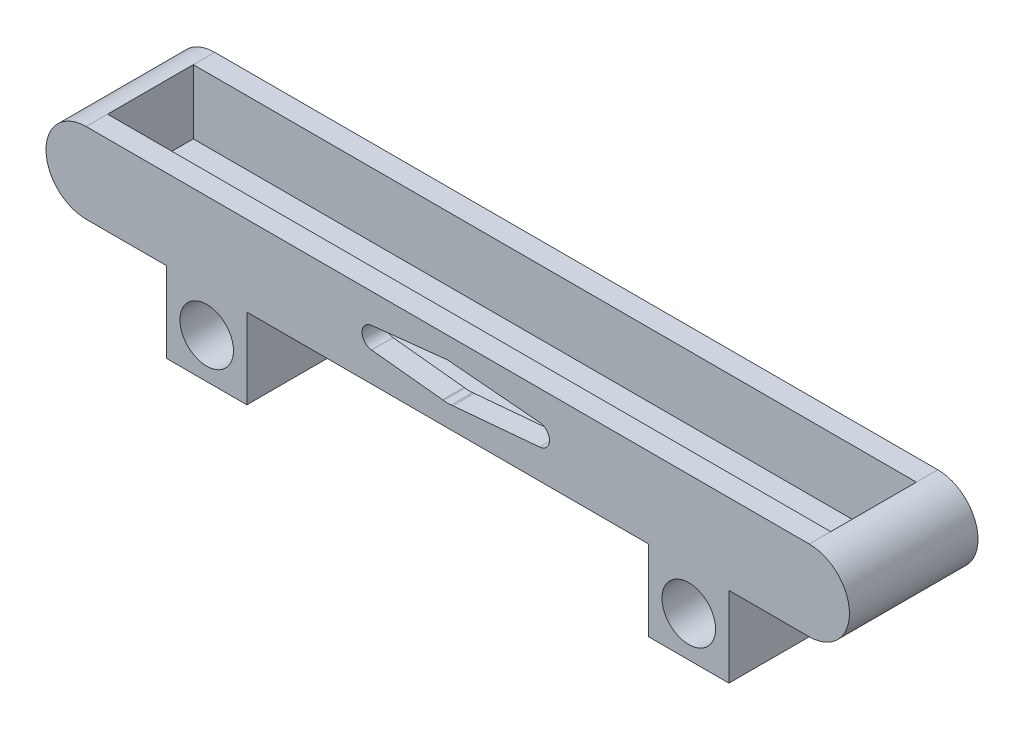
ISO-10303-21;
HEADER;
FILE_DESCRIPTION(('STEP AP214'),'2;1');
FILE_NAME('part.step','',(''),(''),'','','');
FILE_SCHEMA(('AUTOMOTIVE_DESIGN { 1 0 10303 214 1 1 1 1 }'));
ENDSEC;
DATA;
#1=APPLICATION_CONTEXT('core data for automotive mechanical design processes');
#2=APPLICATION_PROTOCOL_DEFINITION('international standard','automotive_design',2000,#1);
#3=PRODUCT_CONTEXT('',#1,'mechanical');
#4=PRODUCT('Part','Part','',(#3));
#5=PRODUCT_RELATED_PRODUCT_CATEGORY('part','',(#4));
#6=PRODUCT_DEFINITION_FORMATION('','',#4);
#7=PRODUCT_DEFINITION_CONTEXT('part definition',#1,'design');
#8=PRODUCT_DEFINITION('design','',#6,#7);
#9=PRODUCT_DEFINITION_SHAPE('','',#8);
#10=(LENGTH_UNIT() NAMED_UNIT(*) SI_UNIT(.MILLI.,.METRE.));
#11=(NAMED_UNIT(*) PLANE_ANGLE_UNIT() SI_UNIT($,.RADIAN.));
#12=(NAMED_UNIT(*) SI_UNIT($,.STERADIAN.) SOLID_ANGLE_UNIT());
#13=UNCERTAINTY_MEASURE_WITH_UNIT(LENGTH_MEASURE(1.E-05),#10,'distance_accuracy_value','');
#14=(GEOMETRIC_REPRESENTATION_CONTEXT(3) GLOBAL_UNCERTAINTY_ASSIGNED_CONTEXT((#13)) GLOBAL_UNIT_ASSIGNED_CONTEXT((#10,
#11,#12)) REPRESENTATION_CONTEXT('',''));
#15=CARTESIAN_POINT('',(0.,0.,0.));
#16=DIRECTION('',(0.,0.,1.));
#17=DIRECTION('',(1.,0.,0.));
#18=AXIS2_PLACEMENT_3D('',#15,#16,#17);
#19=CARTESIAN_POINT('',(0.,7.49999999999999,4.));
#20=DIRECTION('',(0.,-1.,0.));
#21=DIRECTION('',(1.,0.,0.));
#22=AXIS2_PLACEMENT_3D('',#19,#20,#21);
#23=PLANE('',#22);
#24=DIRECTION('',(0.,0.,-1.));
#25=VECTOR('',#24,1.);
#26=CARTESIAN_POINT('',(-67.5,7.49999999999998,4.));
#27=LINE('',#26,#25);
#28=CARTESIAN_POINT('',(-67.5,7.49999999999998,-16.));
#29=VERTEX_POINT('',#28);
#30=CARTESIAN_POINT('',(-67.5,7.49999999999998,-20.));
#31=VERTEX_POINT('',#30);
#32=EDGE_CURVE('E48',#29,#31,#27,.T.);
#33=ORIENTED_EDGE('',*,*,#32,.F.);
#34=DIRECTION('',(-1.,0.,0.));
#35=VECTOR('',#34,1.);
#36=CARTESIAN_POINT('',(-67.5,7.49999999999998,-16.));
#37=LINE('',#36,#35);
#38=CARTESIAN_POINT('',(67.5,7.5,-16.));
#39=VERTEX_POINT('',#38);
#40=EDGE_CURVE('E281',#39,#29,#37,.T.);
#41=ORIENTED_EDGE('',*,*,#40,.F.);
#42=DIRECTION('',(0.,0.,-1.));
#43=VECTOR('',#42,1.);
#44=CARTESIAN_POINT('',(67.5,7.5,4.));
#45=LINE('',#44,#43);
#46=CARTESIAN_POINT('',(67.5,7.5,-20.));
#47=VERTEX_POINT('',#46);
#48=EDGE_CURVE('E91',#39,#47,#45,.T.);
#49=ORIENTED_EDGE('',*,*,#48,.T.);
#50=DIRECTION('',(-1.,0.,0.));
#51=VECTOR('',#50,1.);
#52=CARTESIAN_POINT('',(0.,7.49999999999999,-20.));
#53=LINE('',#52,#51);
#54=EDGE_CURVE('E268',#47,#31,#53,.T.);
#55=ORIENTED_EDGE('',*,*,#54,.T.);
#56=EDGE_LOOP('',(#33,#41,#49,#55));
#57=FACE_BOUND('',#56,.T.);
#58=ADVANCED_FACE('F39',(#57),#23,.F.);
#59=CARTESIAN_POINT('',(67.5,7.5,4.));
#60=VERTEX_POINT('',#59);
#61=CARTESIAN_POINT('',(67.5,7.5,0.));
#62=VERTEX_POINT('',#61);
#63=EDGE_CURVE('E454',#60,#62,#45,.T.);
#64=ORIENTED_EDGE('',*,*,#63,.T.);
#65=DIRECTION('',(1.,0.,0.));
#66=VECTOR('',#65,1.);
#67=CARTESIAN_POINT('',(-67.5,7.49999999999998,0.));
#68=LINE('',#67,#66);
#69=CARTESIAN_POINT('',(-67.5,7.49999999999998,0.));
#70=VERTEX_POINT('',#69);
#71=EDGE_CURVE('E56',#70,#62,#68,.T.);
#72=ORIENTED_EDGE('',*,*,#71,.F.);
#73=CARTESIAN_POINT('',(-67.5,7.49999999999998,4.));
#74=VERTEX_POINT('',#73);
#75=EDGE_CURVE('E11',#74,#70,#27,.T.);
#76=ORIENTED_EDGE('',*,*,#75,.F.);
#77=DIRECTION('',(-1.,0.,0.));
#78=VECTOR('',#77,1.);
#79=CARTESIAN_POINT('',(0.,7.49999999999999,4.));
#80=LINE('',#79,#78);
#81=EDGE_CURVE('E202',#60,#74,#80,.T.);
#82=ORIENTED_EDGE('',*,*,#81,.F.);
#83=EDGE_LOOP('',(#64,#72,#76,#82));
#84=FACE_BOUND('',#83,.T.);
#85=ADVANCED_FACE('F553',(#84),#23,.F.);
#86=CARTESIAN_POINT('',(-67.5,0.,4.));
#87=DIRECTION('',(0.,0.,-1.));
#88=DIRECTION('',(-1.,0.,0.));
#89=AXIS2_PLACEMENT_3D('',#86,#87,#88);
#90=CYLINDRICAL_SURFACE('',#89,7.5);
#91=ORIENTED_EDGE('',*,*,#75,.T.);
#92=DIRECTION('',(0.,0.,1.));
#93=VECTOR('',#92,1.);
#94=CARTESIAN_POINT('',(-67.5,7.49999999999998,-16.));
#95=LINE('',#94,#93);
#96=EDGE_CURVE('E289',#29,#70,#95,.T.);
#97=ORIENTED_EDGE('',*,*,#96,.F.);
#98=ORIENTED_EDGE('',*,*,#32,.T.);
#99=CARTESIAN_POINT('',(-67.5,0.,-20.));
#100=DIRECTION('',(0.,0.,1.));
#101=DIRECTION('',(1.,0.,0.));
#102=AXIS2_PLACEMENT_3D('',#99,#100,#101);
#103=CIRCLE('',#102,7.5);
#104=CARTESIAN_POINT('',(-67.5,-7.50000000000002,-20.));
#105=VERTEX_POINT('',#104);
#106=EDGE_CURVE('E265',#31,#105,#103,.T.);
#107=ORIENTED_EDGE('',*,*,#106,.T.);
#108=DIRECTION('',(0.,0.,-1.));
#109=VECTOR('',#108,1.);
#110=CARTESIAN_POINT('',(-67.5,-7.50000000000002,4.));
#111=LINE('',#110,#109);
#112=CARTESIAN_POINT('',(-67.5,-7.50000000000002,4.));
#113=VERTEX_POINT('',#112);
#114=EDGE_CURVE('E415',#113,#105,#111,.T.);
#115=ORIENTED_EDGE('',*,*,#114,.F.);
#116=CARTESIAN_POINT('',(-67.5,0.,4.));
#117=DIRECTION('',(0.,0.,1.));
#118=DIRECTION('',(1.,0.,0.));
#119=AXIS2_PLACEMENT_3D('',#116,#117,#118);
#120=CIRCLE('',#119,7.5);
#121=EDGE_CURVE('E196',#74,#113,#120,.T.);
#122=ORIENTED_EDGE('',*,*,#121,.F.);
#123=EDGE_LOOP('',(#91,#97,#98,#107,#115,#122));
#124=FACE_BOUND('',#123,.T.);
#125=ADVANCED_FACE('F557',(#124),#90,.T.);
#126=CARTESIAN_POINT('',(0.,-7.50000000000001,4.));
#127=DIRECTION('',(0.,-1.,0.));
#128=DIRECTION('',(1.,0.,0.));
#129=AXIS2_PLACEMENT_3D('',#126,#127,#128);
#130=PLANE('',#129);
#131=ORIENTED_EDGE('',*,*,#114,.T.);
#132=DIRECTION('',(-1.,0.,0.));
#133=VECTOR('',#132,1.);
#134=CARTESIAN_POINT('',(0.,-7.50000000000001,-20.));
#135=LINE('',#134,#133);
#136=CARTESIAN_POINT('',(-52.5,-7.50000000000002,-20.));
#137=VERTEX_POINT('',#136);
#138=EDGE_CURVE('E262',#137,#105,#135,.T.);
#139=ORIENTED_EDGE('',*,*,#138,.F.);
#140=DIRECTION('',(0.,0.,-1.));
#141=VECTOR('',#140,1.);
#142=CARTESIAN_POINT('',(-52.5,-7.50000000000002,4.));
#143=LINE('',#142,#141);
#144=CARTESIAN_POINT('',(-52.5,-7.50000000000002,4.));
#145=VERTEX_POINT('',#144);
#146=EDGE_CURVE('E408',#145,#137,#143,.T.);
#147=ORIENTED_EDGE('',*,*,#146,.F.);
#148=DIRECTION('',(-1.,0.,0.));
#149=VECTOR('',#148,1.);
#150=CARTESIAN_POINT('',(0.,-7.50000000000001,4.));
#151=LINE('',#150,#149);
#152=EDGE_CURVE('E186',#145,#113,#151,.T.);
#153=ORIENTED_EDGE('',*,*,#152,.T.);
#154=EDGE_LOOP('',(#131,#139,#147,#153));
#155=FACE_BOUND('',#154,.T.);
#156=ADVANCED_FACE('F563',(#155),#130,.T.);
#157=CARTESIAN_POINT('',(-52.5,0.,4.));
#158=DIRECTION('',(-1.,0.,0.));
#159=DIRECTION('',(0.,0.,1.));
#160=AXIS2_PLACEMENT_3D('',#157,#158,#159);
#161=PLANE('',#160);
#162=ORIENTED_EDGE('',*,*,#146,.T.);
#163=DIRECTION('',(0.,1.,0.));
#164=VECTOR('',#163,1.);
#165=CARTESIAN_POINT('',(-52.5,0.,-20.));
#166=LINE('',#165,#164);
#167=CARTESIAN_POINT('',(-52.5,-22.5,-20.));
#168=VERTEX_POINT('',#167);
#169=EDGE_CURVE('E259',#168,#137,#166,.T.);
#170=ORIENTED_EDGE('',*,*,#169,.F.);
#171=DIRECTION('',(0.,0.,-1.));
#172=VECTOR('',#171,1.);
#173=CARTESIAN_POINT('',(-52.5,-22.5,4.));
#174=LINE('',#173,#172);
#175=CARTESIAN_POINT('',(-52.5,-22.5,4.));
#176=VERTEX_POINT('',#175);
#177=EDGE_CURVE('E406',#176,#168,#174,.T.);
#178=ORIENTED_EDGE('',*,*,#177,.F.);
#179=DIRECTION('',(0.,1.,0.));
#180=VECTOR('',#179,1.);
#181=CARTESIAN_POINT('',(-52.5,0.,4.));
#182=LINE('',#181,#180);
#183=EDGE_CURVE('E195',#176,#145,#182,.T.);
#184=ORIENTED_EDGE('',*,*,#183,.T.);
#185=EDGE_LOOP('',(#162,#170,#178,#184));
#186=FACE_BOUND('',#185,.T.);
#187=ADVANCED_FACE('F565',(#186),#161,.T.);
#188=CARTESIAN_POINT('',(0.,-22.5,4.));
#189=DIRECTION('',(0.,1.,0.));
#190=DIRECTION('',(-1.,0.,0.));
#191=AXIS2_PLACEMENT_3D('',#188,#189,#190);
#192=PLANE('',#191);
#193=ORIENTED_EDGE('',*,*,#177,.T.);
#194=DIRECTION('',(1.,0.,0.));
#195=VECTOR('',#194,1.);
#196=CARTESIAN_POINT('',(0.,-22.5,-20.));
#197=LINE('',#196,#195);
#198=CARTESIAN_POINT('',(-37.5,-22.5,-20.));
#199=VERTEX_POINT('',#198);
#200=EDGE_CURVE('E256',#168,#199,#197,.T.);
#201=ORIENTED_EDGE('',*,*,#200,.T.);
#202=DIRECTION('',(0.,0.,-1.));
#203=VECTOR('',#202,1.);
#204=CARTESIAN_POINT('',(-37.5,-22.5,4.));
#205=LINE('',#204,#203);
#206=CARTESIAN_POINT('',(-37.5,-22.5,4.));
#207=VERTEX_POINT('',#206);
#208=EDGE_CURVE('E403',#207,#199,#205,.T.);
#209=ORIENTED_EDGE('',*,*,#208,.F.);
#210=DIRECTION('',(1.,0.,0.));
#211=VECTOR('',#210,1.);
#212=CARTESIAN_POINT('',(0.,-22.5,4.));
#213=LINE('',#212,#211);
#214=EDGE_CURVE('E201',#176,#207,#213,.T.);
#215=ORIENTED_EDGE('',*,*,#214,.F.);
#216=EDGE_LOOP('',(#193,#201,#209,#215));
#217=FACE_BOUND('',#216,.T.);
#218=ADVANCED_FACE('F568',(#217),#192,.F.);
#219=CARTESIAN_POINT('',(-37.5,0.,4.));
#220=DIRECTION('',(-1.,0.,0.));
#221=DIRECTION('',(0.,-1.,0.));
#222=AXIS2_PLACEMENT_3D('',#219,#220,#221);
#223=PLANE('',#222);
#224=ORIENTED_EDGE('',*,*,#208,.T.);
#225=DIRECTION('',(0.,1.,0.));
#226=VECTOR('',#225,1.);
#227=CARTESIAN_POINT('',(-37.5,0.,-20.));
#228=LINE('',#227,#226);
#229=CARTESIAN_POINT('',(-37.5,-7.50000000000002,-20.));
#230=VERTEX_POINT('',#229);
#231=EDGE_CURVE('E253',#199,#230,#228,.T.);
#232=ORIENTED_EDGE('',*,*,#231,.T.);
#233=DIRECTION('',(0.,0.,-1.));
#234=VECTOR('',#233,1.);
#235=CARTESIAN_POINT('',(-37.5,-7.50000000000002,4.));
#236=LINE('',#235,#234);
#237=CARTESIAN_POINT('',(-37.5,-7.50000000000002,4.));
#238=VERTEX_POINT('',#237);
#239=EDGE_CURVE('E401',#238,#230,#236,.T.);
#240=ORIENTED_EDGE('',*,*,#239,.F.);
#241=DIRECTION('',(0.,1.,0.));
#242=VECTOR('',#241,1.);
#243=CARTESIAN_POINT('',(-37.5,0.,4.));
#244=LINE('',#243,#242);
#245=EDGE_CURVE('E193',#207,#238,#244,.T.);
#246=ORIENTED_EDGE('',*,*,#245,.F.);
#247=EDGE_LOOP('',(#224,#232,#240,#246));
#248=FACE_BOUND('',#247,.T.);
#249=ADVANCED_FACE('F399',(#248),#223,.F.);
#250=ORIENTED_EDGE('',*,*,#239,.T.);
#251=CARTESIAN_POINT('',(37.5,-7.50000000000001,-20.));
#252=VERTEX_POINT('',#251);
#253=EDGE_CURVE('E252',#252,#230,#135,.T.);
#254=ORIENTED_EDGE('',*,*,#253,.F.);
#255=DIRECTION('',(0.,0.,-1.));
#256=VECTOR('',#255,1.);
#257=CARTESIAN_POINT('',(37.5,-7.50000000000001,4.));
#258=LINE('',#257,#256);
#259=CARTESIAN_POINT('',(37.5,-7.50000000000001,4.));
#260=VERTEX_POINT('',#259);
#261=EDGE_CURVE('E410',#260,#252,#258,.T.);
#262=ORIENTED_EDGE('',*,*,#261,.F.);
#263=EDGE_CURVE('E185',#260,#238,#151,.T.);
#264=ORIENTED_EDGE('',*,*,#263,.T.);
#265=EDGE_LOOP('',(#250,#254,#262,#264));
#266=FACE_BOUND('',#265,.T.);
#267=ADVANCED_FACE('F466',(#266),#130,.T.);
#268=CARTESIAN_POINT('',(37.5,0.,4.));
#269=DIRECTION('',(-1.,0.,0.));
#270=DIRECTION('',(0.,-1.,0.));
#271=AXIS2_PLACEMENT_3D('',#268,#269,#270);
#272=PLANE('',#271);
#273=ORIENTED_EDGE('',*,*,#261,.T.);
#274=DIRECTION('',(0.,1.,0.));
#275=VECTOR('',#274,1.);
#276=CARTESIAN_POINT('',(37.5,0.,-20.));
#277=LINE('',#276,#275);
#278=CARTESIAN_POINT('',(37.5,-22.5,-20.));
#279=VERTEX_POINT('',#278);
#280=EDGE_CURVE('E249',#279,#252,#277,.T.);
#281=ORIENTED_EDGE('',*,*,#280,.F.);
#282=DIRECTION('',(0.,0.,-1.));
#283=VECTOR('',#282,1.);
#284=CARTESIAN_POINT('',(37.5,-22.5,4.));
#285=LINE('',#284,#283);
#286=CARTESIAN_POINT('',(37.5,-22.5,4.));
#287=VERTEX_POINT('',#286);
#288=EDGE_CURVE('E384',#287,#279,#285,.T.);
#289=ORIENTED_EDGE('',*,*,#288,.F.);
#290=DIRECTION('',(0.,1.,0.));
#291=VECTOR('',#290,1.);
#292=CARTESIAN_POINT('',(37.5,0.,4.));
#293=LINE('',#292,#291);
#294=EDGE_CURVE('E192',#287,#260,#293,.T.);
#295=ORIENTED_EDGE('',*,*,#294,.T.);
#296=EDGE_LOOP('',(#273,#281,#289,#295));
#297=FACE_BOUND('',#296,.T.);
#298=ADVANCED_FACE('F464',(#297),#272,.T.);
#299=CARTESIAN_POINT('',(0.,-22.5,4.));
#300=DIRECTION('',(0.,-1.,0.));
#301=DIRECTION('',(0.,0.,-1.));
#302=AXIS2_PLACEMENT_3D('',#299,#300,#301);
#303=PLANE('',#302);
#304=ORIENTED_EDGE('',*,*,#288,.T.);
#305=DIRECTION('',(-1.,0.,0.));
#306=VECTOR('',#305,1.);
#307=CARTESIAN_POINT('',(0.,-22.5,-20.));
#308=LINE('',#307,#306);
#309=CARTESIAN_POINT('',(52.5,-22.5,-20.));
#310=VERTEX_POINT('',#309);
#311=EDGE_CURVE('E246',#310,#279,#308,.T.);
#312=ORIENTED_EDGE('',*,*,#311,.F.);
#313=DIRECTION('',(0.,0.,-1.));
#314=VECTOR('',#313,1.);
#315=CARTESIAN_POINT('',(52.5,-22.5,4.));
#316=LINE('',#315,#314);
#317=CARTESIAN_POINT('',(52.5,-22.5,4.));
#318=VERTEX_POINT('',#317);
#319=EDGE_CURVE('E180',#318,#310,#316,.T.);
#320=ORIENTED_EDGE('',*,*,#319,.F.);
#321=DIRECTION('',(-1.,0.,0.));
#322=VECTOR('',#321,1.);
#323=CARTESIAN_POINT('',(0.,-22.5,4.));
#324=LINE('',#323,#322);
#325=EDGE_CURVE('E167',#318,#287,#324,.T.);
#326=ORIENTED_EDGE('',*,*,#325,.T.);
#327=EDGE_LOOP('',(#304,#312,#320,#326));
#328=FACE_BOUND('',#327,.T.);
#329=ADVANCED_FACE('F386',(#328),#303,.T.);
#330=CARTESIAN_POINT('',(52.5,0.,4.));
#331=DIRECTION('',(-1.,0.,0.));
#332=DIRECTION('',(0.,-1.,0.));
#333=AXIS2_PLACEMENT_3D('',#330,#331,#332);
#334=PLANE('',#333);
#335=ORIENTED_EDGE('',*,*,#319,.T.);
#336=DIRECTION('',(0.,1.,0.));
#337=VECTOR('',#336,1.);
#338=CARTESIAN_POINT('',(52.5,0.,-20.));
#339=LINE('',#338,#337);
#340=CARTESIAN_POINT('',(52.5,-7.50000000000001,-20.));
#341=VERTEX_POINT('',#340);
#342=EDGE_CURVE('E176',#310,#341,#339,.T.);
#343=ORIENTED_EDGE('',*,*,#342,.T.);
#344=DIRECTION('',(0.,0.,-1.));
#345=VECTOR('',#344,1.);
#346=CARTESIAN_POINT('',(52.5,-7.50000000000001,4.));
#347=LINE('',#346,#345);
#348=CARTESIAN_POINT('',(52.5,-7.50000000000001,4.));
#349=VERTEX_POINT('',#348);
#350=EDGE_CURVE('E173',#349,#341,#347,.T.);
#351=ORIENTED_EDGE('',*,*,#350,.F.);
#352=DIRECTION('',(0.,1.,0.));
#353=VECTOR('',#352,1.);
#354=CARTESIAN_POINT('',(52.5,0.,4.));
#355=LINE('',#354,#353);
#356=EDGE_CURVE('E159',#318,#349,#355,.T.);
#357=ORIENTED_EDGE('',*,*,#356,.F.);
#358=EDGE_LOOP('',(#335,#343,#351,#357));
#359=FACE_BOUND('',#358,.T.);
#360=ADVANCED_FACE('F174',(#359),#334,.F.);
#361=ORIENTED_EDGE('',*,*,#350,.T.);
#362=CARTESIAN_POINT('',(67.5,-7.5,-20.));
#363=VERTEX_POINT('',#362);
#364=EDGE_CURVE('E244',#363,#341,#135,.T.);
#365=ORIENTED_EDGE('',*,*,#364,.F.);
#366=DIRECTION('',(0.,0.,-1.));
#367=VECTOR('',#366,1.);
#368=CARTESIAN_POINT('',(67.5,-7.5,4.));
#369=LINE('',#368,#367);
#370=CARTESIAN_POINT('',(67.5,-7.5,4.));
#371=VERTEX_POINT('',#370);
#372=EDGE_CURVE('E181',#371,#363,#369,.T.);
#373=ORIENTED_EDGE('',*,*,#372,.F.);
#374=EDGE_CURVE('E164',#371,#349,#151,.T.);
#375=ORIENTED_EDGE('',*,*,#374,.T.);
#376=EDGE_LOOP('',(#361,#365,#373,#375));
#377=FACE_BOUND('',#376,.T.);
#378=ADVANCED_FACE('F183',(#377),#130,.T.);
#379=CARTESIAN_POINT('',(0.,0.,4.));
#380=DIRECTION('',(0.,0.,-1.));
#381=DIRECTION('',(-1.,0.,0.));
#382=AXIS2_PLACEMENT_3D('',#379,#380,#381);
#383=CYLINDRICAL_SURFACE('',#382,3.5);
#384=CARTESIAN_POINT('',(0.,0.,0.));
#385=DIRECTION('',(0.,0.,1.));
#386=DIRECTION('',(1.,0.,0.));
#387=AXIS2_PLACEMENT_3D('',#384,#385,#386);
#388=CIRCLE('',#387,3.5);
#389=CARTESIAN_POINT('',(0.659215340358417,3.43735874401205,0.));
#390=VERTEX_POINT('',#389);
#391=CARTESIAN_POINT('',(-0.755897231967522,3.41739950469708,0.));
#392=VERTEX_POINT('',#391);
#393=EDGE_CURVE('E237',#390,#392,#388,.T.);
#394=ORIENTED_EDGE('',*,*,#393,.F.);
#395=DIRECTION('',(0.,0.,-1.));
#396=VECTOR('',#395,1.);
#397=CARTESIAN_POINT('',(0.659215340358417,3.43735874401205,4.));
#398=LINE('',#397,#396);
#399=CARTESIAN_POINT('',(0.659215340358417,3.43735874401205,4.));
#400=VERTEX_POINT('',#399);
#401=EDGE_CURVE('E43',#400,#390,#398,.T.);
#402=ORIENTED_EDGE('',*,*,#401,.F.);
#403=CARTESIAN_POINT('',(0.,0.,4.));
#404=DIRECTION('',(0.,0.,1.));
#405=DIRECTION('',(1.,0.,0.));
#406=AXIS2_PLACEMENT_3D('',#403,#404,#405);
#407=CIRCLE('',#406,3.5);
#408=CARTESIAN_POINT('',(-0.755897231967522,3.41739950469708,4.));
#409=VERTEX_POINT('',#408);
#410=EDGE_CURVE('E230',#400,#409,#407,.T.);
#411=ORIENTED_EDGE('',*,*,#410,.T.);
#412=DIRECTION('',(0.,0.,-1.));
#413=VECTOR('',#412,1.);
#414=CARTESIAN_POINT('',(-0.755897231967522,3.41739950469708,4.));
#415=LINE('',#414,#413);
#416=EDGE_CURVE('E417',#409,#392,#415,.T.);
#417=ORIENTED_EDGE('',*,*,#416,.T.);
#418=EDGE_LOOP('',(#394,#402,#411,#417));
#419=FACE_BOUND('',#418,.T.);
#420=ADVANCED_FACE('F536',(#419),#383,.F.);
#421=CARTESIAN_POINT('',(0.0923349657358066,-6.54656065875096,4.));
#422=DIRECTION('',(0.,0.,-1.));
#423=DIRECTION('',(-1.,0.,0.));
#424=AXIS2_PLACEMENT_3D('',#421,#422,#423);
#425=CYLINDRICAL_SURFACE('',#424,10.);
#426=CARTESIAN_POINT('',(0.0923349657358066,-6.54656065875096,0.));
#427=DIRECTION('',(0.,0.,1.));
#428=DIRECTION('',(1.,0.,0.));
#429=AXIS2_PLACEMENT_3D('',#426,#427,#428);
#430=CIRCLE('',#429,10.);
#431=CARTESIAN_POINT('',(0.966800983112849,3.41513142565181,0.));
#432=VERTEX_POINT('',#431);
#433=EDGE_CURVE('E478',#432,#390,#430,.T.);
#434=ORIENTED_EDGE('',*,*,#433,.F.);
#435=DIRECTION('',(0.,0.,-1.));
#436=VECTOR('',#435,1.);
#437=CARTESIAN_POINT('',(0.966800983112849,3.41513142565181,4.));
#438=LINE('',#437,#436);
#439=CARTESIAN_POINT('',(0.966800983112849,3.41513142565181,4.));
#440=VERTEX_POINT('',#439);
#441=EDGE_CURVE('E447',#440,#432,#438,.T.);
#442=ORIENTED_EDGE('',*,*,#441,.F.);
#443=CARTESIAN_POINT('',(0.0923349657358066,-6.54656065875096,4.));
#444=DIRECTION('',(0.,0.,1.));
#445=DIRECTION('',(1.,0.,0.));
#446=AXIS2_PLACEMENT_3D('',#443,#444,#445);
#447=CIRCLE('',#446,10.);
#448=EDGE_CURVE('E227',#440,#400,#447,.T.);
#449=ORIENTED_EDGE('',*,*,#448,.T.);
#450=ORIENTED_EDGE('',*,*,#401,.T.);
#451=EDGE_LOOP('',(#434,#442,#449,#450));
#452=FACE_BOUND('',#451,.T.);
#453=ADVANCED_FACE('F539',(#452),#425,.F.);
#454=CARTESIAN_POINT('',(0.304890642118444,3.47323582145585,4.));
#455=DIRECTION('',(0.0874466017377044,0.996169208440277,0.));
#456=DIRECTION('',(-0.996169208440277,0.0874466017377044,0.));
#457=AXIS2_PLACEMENT_3D('',#454,#455,#456);
#458=PLANE('',#457);
#459=DIRECTION('',(0.996169208440277,-0.0874466017377044,0.));
#460=VECTOR('',#459,1.);
#461=CARTESIAN_POINT('',(0.304890642118444,3.47323582145585,0.));
#462=LINE('',#461,#460);
#463=CARTESIAN_POINT('',(17.1748932034754,1.99233841688055,0.));
#464=VERTEX_POINT('',#463);
#465=EDGE_CURVE('E481',#432,#464,#462,.T.);
#466=ORIENTED_EDGE('',*,*,#465,.T.);
#467=DIRECTION('',(0.,0.,-1.));
#468=VECTOR('',#467,1.);
#469=CARTESIAN_POINT('',(17.1748932034754,1.99233841688055,4.));
#470=LINE('',#469,#468);
#471=CARTESIAN_POINT('',(17.1748932034754,1.99233841688055,4.));
#472=VERTEX_POINT('',#471);
#473=EDGE_CURVE('E445',#472,#464,#470,.T.);
#474=ORIENTED_EDGE('',*,*,#473,.F.);
#475=DIRECTION('',(0.996169208440277,-0.0874466017377044,0.));
#476=VECTOR('',#475,1.);
#477=CARTESIAN_POINT('',(0.304890642118444,3.47323582145585,4.));
#478=LINE('',#477,#476);
#479=EDGE_CURVE('E225',#440,#472,#478,.T.);
#480=ORIENTED_EDGE('',*,*,#479,.F.);
#481=ORIENTED_EDGE('',*,*,#441,.T.);
#482=EDGE_LOOP('',(#466,#474,#480,#481));
#483=FACE_BOUND('',#482,.T.);
#484=ADVANCED_FACE('F41',(#483),#458,.F.);
#485=CARTESIAN_POINT('',(17.,0.,4.));
#486=DIRECTION('',(0.,0.,-1.));
#487=DIRECTION('',(-1.,0.,0.));
#488=AXIS2_PLACEMENT_3D('',#485,#486,#487);
#489=CYLINDRICAL_SURFACE('',#488,2.);
#490=CARTESIAN_POINT('',(17.,0.,0.));
#491=DIRECTION('',(0.,0.,1.));
#492=DIRECTION('',(1.,0.,0.));
#493=AXIS2_PLACEMENT_3D('',#490,#491,#492);
#494=CIRCLE('',#493,2.);
#495=CARTESIAN_POINT('',(17.1748932034754,-1.99233841688056,0.));
#496=VERTEX_POINT('',#495);
#497=EDGE_CURVE('E79',#464,#496,#494,.F.);
#498=ORIENTED_EDGE('',*,*,#497,.T.);
#499=DIRECTION('',(0.,0.,-1.));
#500=VECTOR('',#499,1.);
#501=CARTESIAN_POINT('',(17.1748932034754,-1.99233841688056,4.));
#502=LINE('',#501,#500);
#503=CARTESIAN_POINT('',(17.1748932034754,-1.99233841688056,4.));
#504=VERTEX_POINT('',#503);
#505=EDGE_CURVE('E442',#504,#496,#502,.T.);
#506=ORIENTED_EDGE('',*,*,#505,.F.);
#507=CARTESIAN_POINT('',(17.,0.,4.));
#508=DIRECTION('',(0.,0.,1.));
#509=DIRECTION('',(1.,0.,0.));
#510=AXIS2_PLACEMENT_3D('',#507,#508,#509);
#511=CIRCLE('',#510,2.);
#512=EDGE_CURVE('E223',#472,#504,#511,.F.);
#513=ORIENTED_EDGE('',*,*,#512,.F.);
#514=ORIENTED_EDGE('',*,*,#473,.T.);
#515=EDGE_LOOP('',(#498,#506,#513,#514));
#516=FACE_BOUND('',#515,.T.);
#517=ADVANCED_FACE('F532',(#516),#489,.F.);
#518=CARTESIAN_POINT('',(0.304890642118442,-3.47323582145585,4.));
#519=DIRECTION('',(-0.0874466017377038,0.996169208440277,0.));
#520=DIRECTION('',(-0.996169208440277,-0.0874466017377038,0.));
#521=AXIS2_PLACEMENT_3D('',#518,#519,#520);
#522=PLANE('',#521);
#523=DIRECTION('',(0.996169208440277,0.0874466017377038,0.));
#524=VECTOR('',#523,1.);
#525=CARTESIAN_POINT('',(0.304890642118442,-3.47323582145585,0.));
#526=LINE('',#525,#524);
#527=CARTESIAN_POINT('',(0.966800983112841,-3.41513142565181,0.));
#528=VERTEX_POINT('',#527);
#529=EDGE_CURVE('E484',#528,#496,#526,.T.);
#530=ORIENTED_EDGE('',*,*,#529,.F.);
#531=DIRECTION('',(0.,0.,-1.));
#532=VECTOR('',#531,1.);
#533=CARTESIAN_POINT('',(0.966800983112841,-3.41513142565181,4.));
#534=LINE('',#533,#532);
#535=CARTESIAN_POINT('',(0.966800983112841,-3.41513142565181,4.));
#536=VERTEX_POINT('',#535);
#537=EDGE_CURVE('E439',#536,#528,#534,.T.);
#538=ORIENTED_EDGE('',*,*,#537,.F.);
#539=DIRECTION('',(0.996169208440277,0.0874466017377038,0.));
#540=VECTOR('',#539,1.);
#541=CARTESIAN_POINT('',(0.304890642118442,-3.47323582145585,4.));
#542=LINE('',#541,#540);
#543=EDGE_CURVE('E220',#536,#504,#542,.T.);
#544=ORIENTED_EDGE('',*,*,#543,.T.);
#545=ORIENTED_EDGE('',*,*,#505,.T.);
#546=EDGE_LOOP('',(#530,#538,#544,#545));
#547=FACE_BOUND('',#546,.T.);
#548=ADVANCED_FACE('F528',(#547),#522,.T.);
#549=CARTESIAN_POINT('',(0.0923349657358031,6.54656065875096,4.));
#550=DIRECTION('',(0.,0.,-1.));
#551=DIRECTION('',(-1.,0.,0.));
#552=AXIS2_PLACEMENT_3D('',#549,#550,#551);
#553=CYLINDRICAL_SURFACE('',#552,10.);
#554=CARTESIAN_POINT('',(0.0923349657358031,6.54656065875096,0.));
#555=DIRECTION('',(0.,0.,1.));
#556=DIRECTION('',(1.,0.,0.));
#557=AXIS2_PLACEMENT_3D('',#554,#555,#556);
#558=CIRCLE('',#557,10.);
#559=CARTESIAN_POINT('',(0.659215340358419,-3.43735874401205,0.));
#560=VERTEX_POINT('',#559);
#561=EDGE_CURVE('E486',#560,#528,#558,.T.);
#562=ORIENTED_EDGE('',*,*,#561,.F.);
#563=DIRECTION('',(0.,0.,-1.));
#564=VECTOR('',#563,1.);
#565=CARTESIAN_POINT('',(0.659215340358419,-3.43735874401205,4.));
#566=LINE('',#565,#564);
#567=CARTESIAN_POINT('',(0.659215340358419,-3.43735874401205,4.));
#568=VERTEX_POINT('',#567);
#569=EDGE_CURVE('E436',#568,#560,#566,.T.);
#570=ORIENTED_EDGE('',*,*,#569,.F.);
#571=CARTESIAN_POINT('',(0.0923349657358031,6.54656065875096,4.));
#572=DIRECTION('',(0.,0.,1.));
#573=DIRECTION('',(1.,0.,0.));
#574=AXIS2_PLACEMENT_3D('',#571,#572,#573);
#575=CIRCLE('',#574,10.);
#576=EDGE_CURVE('E216',#568,#536,#575,.T.);
#577=ORIENTED_EDGE('',*,*,#576,.T.);
#578=ORIENTED_EDGE('',*,*,#537,.T.);
#579=EDGE_LOOP('',(#562,#570,#577,#578));
#580=FACE_BOUND('',#579,.T.);
#581=ADVANCED_FACE('F524',(#580),#553,.F.);
#582=CARTESIAN_POINT('',(-0.755897231967521,-3.41739950469708,0.));
#583=VERTEX_POINT('',#582);
#584=EDGE_CURVE('E479',#583,#560,#388,.T.);
#585=ORIENTED_EDGE('',*,*,#584,.F.);
#586=DIRECTION('',(0.,0.,-1.));
#587=VECTOR('',#586,1.);
#588=CARTESIAN_POINT('',(-0.755897231967521,-3.41739950469708,4.));
#589=LINE('',#588,#587);
#590=CARTESIAN_POINT('',(-0.755897231967521,-3.41739950469708,4.));
#591=VERTEX_POINT('',#590);
#592=EDGE_CURVE('E433',#591,#583,#589,.T.);
#593=ORIENTED_EDGE('',*,*,#592,.F.);
#594=EDGE_CURVE('E219',#591,#568,#407,.T.);
#595=ORIENTED_EDGE('',*,*,#594,.T.);
#596=ORIENTED_EDGE('',*,*,#569,.T.);
#597=EDGE_LOOP('',(#585,#593,#595,#596));
#598=FACE_BOUND('',#597,.T.);
#599=ADVANCED_FACE('F520',(#598),#383,.F.);
#600=CARTESIAN_POINT('',(-0.965077795265276,-3.3973760995391,0.));
#601=VERTEX_POINT('',#600);
#602=EDGE_CURVE('E488',#601,#583,#558,.T.);
#603=ORIENTED_EDGE('',*,*,#602,.F.);
#604=DIRECTION('',(0.,0.,-1.));
#605=VECTOR('',#604,1.);
#606=CARTESIAN_POINT('',(-0.965077795265276,-3.3973760995391,4.));
#607=LINE('',#606,#605);
#608=CARTESIAN_POINT('',(-0.965077795265276,-3.3973760995391,4.));
#609=VERTEX_POINT('',#608);
#610=EDGE_CURVE('E430',#609,#601,#607,.T.);
#611=ORIENTED_EDGE('',*,*,#610,.F.);
#612=EDGE_CURVE('E215',#609,#591,#575,.T.);
#613=ORIENTED_EDGE('',*,*,#612,.T.);
#614=ORIENTED_EDGE('',*,*,#592,.T.);
#615=EDGE_LOOP('',(#603,#611,#613,#614));
#616=FACE_BOUND('',#615,.T.);
#617=ADVANCED_FACE('F515',(#616),#553,.F.);
#618=CARTESIAN_POINT('',(-0.368019596798126,-3.46086573885052,4.));
#619=DIRECTION('',(-0.105741276100108,-0.994393675829005,0.));
#620=DIRECTION('',(0.994393675829005,-0.105741276100108,0.));
#621=AXIS2_PLACEMENT_3D('',#618,#619,#620);
#622=PLANE('',#621);
#623=DIRECTION('',(-0.994393675829005,0.105741276100108,0.));
#624=VECTOR('',#623,1.);
#625=CARTESIAN_POINT('',(-0.368019596798126,-3.46086573885052,0.));
#626=LINE('',#625,#624);
#627=CARTESIAN_POINT('',(-14.2114825522002,-1.98878735165802,0.));
#628=VERTEX_POINT('',#627);
#629=EDGE_CURVE('E489',#601,#628,#626,.T.);
#630=ORIENTED_EDGE('',*,*,#629,.T.);
#631=DIRECTION('',(0.,0.,-1.));
#632=VECTOR('',#631,1.);
#633=CARTESIAN_POINT('',(-14.2114825522002,-1.98878735165802,4.));
#634=LINE('',#633,#632);
#635=CARTESIAN_POINT('',(-14.2114825522002,-1.98878735165802,4.));
#636=VERTEX_POINT('',#635);
#637=EDGE_CURVE('E427',#636,#628,#634,.T.);
#638=ORIENTED_EDGE('',*,*,#637,.F.);
#639=DIRECTION('',(-0.994393675829005,0.105741276100108,0.));
#640=VECTOR('',#639,1.);
#641=CARTESIAN_POINT('',(-0.368019596798126,-3.46086573885052,4.));
#642=LINE('',#641,#640);
#643=EDGE_CURVE('E213',#609,#636,#642,.T.);
#644=ORIENTED_EDGE('',*,*,#643,.F.);
#645=ORIENTED_EDGE('',*,*,#610,.T.);
#646=EDGE_LOOP('',(#630,#638,#644,#645));
#647=FACE_BOUND('',#646,.T.);
#648=ADVANCED_FACE('F510',(#647),#622,.F.);
#649=CARTESIAN_POINT('',(-14.,0.,4.));
#650=DIRECTION('',(0.,0.,-1.));
#651=DIRECTION('',(-1.,0.,0.));
#652=AXIS2_PLACEMENT_3D('',#649,#650,#651);
#653=CYLINDRICAL_SURFACE('',#652,2.);
#654=CARTESIAN_POINT('',(-14.,0.,0.));
#655=DIRECTION('',(0.,0.,1.));
#656=DIRECTION('',(1.,0.,0.));
#657=AXIS2_PLACEMENT_3D('',#654,#655,#656);
#658=CIRCLE('',#657,2.);
#659=CARTESIAN_POINT('',(-14.2114825522002,1.988787351658,0.));
#660=VERTEX_POINT('',#659);
#661=EDGE_CURVE('E491',#660,#628,#658,.T.);
#662=ORIENTED_EDGE('',*,*,#661,.F.);
#663=DIRECTION('',(0.,0.,-1.));
#664=VECTOR('',#663,1.);
#665=CARTESIAN_POINT('',(-14.2114825522002,1.988787351658,4.));
#666=LINE('',#665,#664);
#667=CARTESIAN_POINT('',(-14.2114825522002,1.988787351658,4.));
#668=VERTEX_POINT('',#667);
#669=EDGE_CURVE('E424',#668,#660,#666,.T.);
#670=ORIENTED_EDGE('',*,*,#669,.F.);
#671=CARTESIAN_POINT('',(-14.,0.,4.));
#672=DIRECTION('',(0.,0.,1.));
#673=DIRECTION('',(1.,0.,0.));
#674=AXIS2_PLACEMENT_3D('',#671,#672,#673);
#675=CIRCLE('',#674,2.);
#676=EDGE_CURVE('E210',#668,#636,#675,.T.);
#677=ORIENTED_EDGE('',*,*,#676,.T.);
#678=ORIENTED_EDGE('',*,*,#637,.T.);
#679=EDGE_LOOP('',(#662,#670,#677,#678));
#680=FACE_BOUND('',#679,.T.);
#681=ADVANCED_FACE('F506',(#680),#653,.F.);
#682=CARTESIAN_POINT('',(-0.368019596798129,3.46086573885052,4.));
#683=DIRECTION('',(0.105741276100109,-0.994393675829005,0.));
#684=DIRECTION('',(0.994393675829005,0.105741276100109,0.));
#685=AXIS2_PLACEMENT_3D('',#682,#683,#684);
#686=PLANE('',#685);
#687=DIRECTION('',(-0.994393675829005,-0.105741276100109,0.));
#688=VECTOR('',#687,1.);
#689=CARTESIAN_POINT('',(-0.368019596798129,3.46086573885052,0.));
#690=LINE('',#689,#688);
#691=CARTESIAN_POINT('',(-0.965077795265282,3.39737609953909,0.));
#692=VERTEX_POINT('',#691);
#693=EDGE_CURVE('E459',#692,#660,#690,.T.);
#694=ORIENTED_EDGE('',*,*,#693,.F.);
#695=DIRECTION('',(0.,0.,-1.));
#696=VECTOR('',#695,1.);
#697=CARTESIAN_POINT('',(-0.965077795265282,3.39737609953909,4.));
#698=LINE('',#697,#696);
#699=CARTESIAN_POINT('',(-0.965077795265282,3.39737609953909,4.));
#700=VERTEX_POINT('',#699);
#701=EDGE_CURVE('E420',#700,#692,#698,.T.);
#702=ORIENTED_EDGE('',*,*,#701,.F.);
#703=DIRECTION('',(-0.994393675829005,-0.105741276100109,0.));
#704=VECTOR('',#703,1.);
#705=CARTESIAN_POINT('',(-0.368019596798129,3.46086573885052,4.));
#706=LINE('',#705,#704);
#707=EDGE_CURVE('E207',#700,#668,#706,.T.);
#708=ORIENTED_EDGE('',*,*,#707,.T.);
#709=ORIENTED_EDGE('',*,*,#669,.T.);
#710=EDGE_LOOP('',(#694,#702,#708,#709));
#711=FACE_BOUND('',#710,.T.);
#712=ADVANCED_FACE('F503',(#711),#686,.T.);
#713=CARTESIAN_POINT('',(-45.,-15.,4.));
#714=DIRECTION('',(0.,0.,-1.));
#715=DIRECTION('',(-1.,0.,0.));
#716=AXIS2_PLACEMENT_3D('',#713,#714,#715);
#717=CYLINDRICAL_SURFACE('',#716,5.);
#718=CARTESIAN_POINT('',(-45.,-15.,4.));
#719=DIRECTION('',(0.,0.,1.));
#720=DIRECTION('',(1.,0.,0.));
#721=AXIS2_PLACEMENT_3D('',#718,#719,#720);
#722=CIRCLE('',#721,5.);
#723=CARTESIAN_POINT('',(-40.,-15.,4.));
#724=VERTEX_POINT('',#723);
#725=EDGE_CURVE('E187',#724,#724,#722,.T.);
#726=ORIENTED_EDGE('',*,*,#725,.T.);
#727=EDGE_LOOP('',(#726));
#728=FACE_BOUND('',#727,.T.);
#729=CARTESIAN_POINT('',(-45.,-15.,-20.));
#730=DIRECTION('',(0.,0.,1.));
#731=DIRECTION('',(1.,0.,0.));
#732=AXIS2_PLACEMENT_3D('',#729,#730,#731);
#733=CIRCLE('',#732,5.);
#734=CARTESIAN_POINT('',(-40.,-15.,-20.));
#735=VERTEX_POINT('',#734);
#736=EDGE_CURVE('E238',#735,#735,#733,.T.);
#737=ORIENTED_EDGE('',*,*,#736,.F.);
#738=EDGE_LOOP('',(#737));
#739=FACE_BOUND('',#738,.T.);
#740=ADVANCED_FACE('F584',(#728,#739),#717,.F.);
#741=CARTESIAN_POINT('',(67.5,0.,4.));
#742=DIRECTION('',(0.,0.,-1.));
#743=DIRECTION('',(-1.,0.,0.));
#744=AXIS2_PLACEMENT_3D('',#741,#742,#743);
#745=CYLINDRICAL_SURFACE('',#744,7.5);
#746=ORIENTED_EDGE('',*,*,#372,.T.);
#747=CARTESIAN_POINT('',(67.5,0.,-20.));
#748=DIRECTION('',(0.,0.,1.));
#749=DIRECTION('',(1.,0.,0.));
#750=AXIS2_PLACEMENT_3D('',#747,#748,#749);
#751=CIRCLE('',#750,7.5);
#752=EDGE_CURVE('E241',#363,#47,#751,.T.);
#753=ORIENTED_EDGE('',*,*,#752,.T.);
#754=ORIENTED_EDGE('',*,*,#48,.F.);
#755=DIRECTION('',(0.,0.,-1.));
#756=VECTOR('',#755,1.);
#757=CARTESIAN_POINT('',(67.5,7.5,-16.));
#758=LINE('',#757,#756);
#759=EDGE_CURVE('E285',#62,#39,#758,.T.);
#760=ORIENTED_EDGE('',*,*,#759,.F.);
#761=ORIENTED_EDGE('',*,*,#63,.F.);
#762=CARTESIAN_POINT('',(67.5,0.,4.));
#763=DIRECTION('',(0.,0.,1.));
#764=DIRECTION('',(1.,0.,0.));
#765=AXIS2_PLACEMENT_3D('',#762,#763,#764);
#766=CIRCLE('',#765,7.5);
#767=EDGE_CURVE('E65',#371,#60,#766,.T.);
#768=ORIENTED_EDGE('',*,*,#767,.F.);
#769=EDGE_LOOP('',(#746,#753,#754,#760,#761,#768));
#770=FACE_BOUND('',#769,.T.);
#771=ADVANCED_FACE('F551',(#770),#745,.T.);
#772=EDGE_CURVE('E233',#392,#692,#430,.T.);
#773=ORIENTED_EDGE('',*,*,#772,.F.);
#774=ORIENTED_EDGE('',*,*,#416,.F.);
#775=EDGE_CURVE('E204',#409,#700,#447,.T.);
#776=ORIENTED_EDGE('',*,*,#775,.T.);
#777=ORIENTED_EDGE('',*,*,#701,.T.);
#778=EDGE_LOOP('',(#773,#774,#776,#777));
#779=FACE_BOUND('',#778,.T.);
#780=ADVANCED_FACE('F499',(#779),#425,.F.);
#781=CARTESIAN_POINT('',(45.,-15.,4.));
#782=DIRECTION('',(0.,0.,-1.));
#783=DIRECTION('',(-1.,0.,0.));
#784=AXIS2_PLACEMENT_3D('',#781,#782,#783);
#785=CYLINDRICAL_SURFACE('',#784,4.99999999999998);
#786=CARTESIAN_POINT('',(45.,-15.,4.));
#787=DIRECTION('',(0.,0.,1.));
#788=DIRECTION('',(1.,0.,0.));
#789=AXIS2_PLACEMENT_3D('',#786,#787,#788);
#790=CIRCLE('',#789,4.99999999999998);
#791=CARTESIAN_POINT('',(50.,-15.,4.));
#792=VERTEX_POINT('',#791);
#793=EDGE_CURVE('E421',#792,#792,#790,.F.);
#794=ORIENTED_EDGE('',*,*,#793,.F.);
#795=EDGE_LOOP('',(#794));
#796=FACE_BOUND('',#795,.T.);
#797=CARTESIAN_POINT('',(45.,-15.,-20.));
#798=DIRECTION('',(0.,0.,1.));
#799=DIRECTION('',(1.,0.,0.));
#800=AXIS2_PLACEMENT_3D('',#797,#798,#799);
#801=CIRCLE('',#800,4.99999999999998);
#802=CARTESIAN_POINT('',(50.,-15.,-20.));
#803=VERTEX_POINT('',#802);
#804=EDGE_CURVE('E234',#803,#803,#801,.F.);
#805=ORIENTED_EDGE('',*,*,#804,.T.);
#806=EDGE_LOOP('',(#805));
#807=FACE_BOUND('',#806,.T.);
#808=ADVANCED_FACE('F550',(#796,#807),#785,.F.);
#809=CARTESIAN_POINT('',(0.,0.,4.));
#810=DIRECTION('',(0.,0.,1.));
#811=DIRECTION('',(1.,0.,0.));
#812=AXIS2_PLACEMENT_3D('',#809,#810,#811);
#813=PLANE('',#812);
#814=ORIENTED_EDGE('',*,*,#410,.F.);
#815=ORIENTED_EDGE('',*,*,#448,.F.);
#816=ORIENTED_EDGE('',*,*,#479,.T.);
#817=ORIENTED_EDGE('',*,*,#512,.T.);
#818=ORIENTED_EDGE('',*,*,#543,.F.);
#819=ORIENTED_EDGE('',*,*,#576,.F.);
#820=ORIENTED_EDGE('',*,*,#594,.F.);
#821=ORIENTED_EDGE('',*,*,#612,.F.);
#822=ORIENTED_EDGE('',*,*,#643,.T.);
#823=ORIENTED_EDGE('',*,*,#676,.F.);
#824=ORIENTED_EDGE('',*,*,#707,.F.);
#825=ORIENTED_EDGE('',*,*,#775,.F.);
#826=EDGE_LOOP('',(#814,#815,#816,#817,#818,#819,#820,#821,#822,#823,#824,#825));
#827=FACE_BOUND('',#826,.T.);
#828=ORIENTED_EDGE('',*,*,#81,.T.);
#829=ORIENTED_EDGE('',*,*,#121,.T.);
#830=ORIENTED_EDGE('',*,*,#152,.F.);
#831=ORIENTED_EDGE('',*,*,#183,.F.);
#832=ORIENTED_EDGE('',*,*,#214,.T.);
#833=ORIENTED_EDGE('',*,*,#245,.T.);
#834=ORIENTED_EDGE('',*,*,#263,.F.);
#835=ORIENTED_EDGE('',*,*,#294,.F.);
#836=ORIENTED_EDGE('',*,*,#325,.F.);
#837=ORIENTED_EDGE('',*,*,#356,.T.);
#838=ORIENTED_EDGE('',*,*,#374,.F.);
#839=ORIENTED_EDGE('',*,*,#767,.T.);
#840=EDGE_LOOP('',(#828,#829,#830,#831,#832,#833,#834,#835,#836,#837,#838,#839));
#841=FACE_BOUND('',#840,.T.);
#842=ORIENTED_EDGE('',*,*,#725,.F.);
#843=EDGE_LOOP('',(#842));
#844=FACE_BOUND('',#843,.T.);
#845=ORIENTED_EDGE('',*,*,#793,.T.);
#846=EDGE_LOOP('',(#845));
#847=FACE_BOUND('',#846,.T.);
#848=ADVANCED_FACE('F161',(#827,#841,#844,#847),#813,.T.);
#849=CARTESIAN_POINT('',(0.,0.,-20.));
#850=DIRECTION('',(0.,0.,1.));
#851=DIRECTION('',(1.,0.,0.));
#852=AXIS2_PLACEMENT_3D('',#849,#850,#851);
#853=PLANE('',#852);
#854=ORIENTED_EDGE('',*,*,#54,.F.);
#855=ORIENTED_EDGE('',*,*,#752,.F.);
#856=ORIENTED_EDGE('',*,*,#364,.T.);
#857=ORIENTED_EDGE('',*,*,#342,.F.);
#858=ORIENTED_EDGE('',*,*,#311,.T.);
#859=ORIENTED_EDGE('',*,*,#280,.T.);
#860=ORIENTED_EDGE('',*,*,#253,.T.);
#861=ORIENTED_EDGE('',*,*,#231,.F.);
#862=ORIENTED_EDGE('',*,*,#200,.F.);
#863=ORIENTED_EDGE('',*,*,#169,.T.);
#864=ORIENTED_EDGE('',*,*,#138,.T.);
#865=ORIENTED_EDGE('',*,*,#106,.F.);
#866=EDGE_LOOP('',(#854,#855,#856,#857,#858,#859,#860,#861,#862,#863,#864,#865));
#867=FACE_BOUND('',#866,.T.);
#868=ORIENTED_EDGE('',*,*,#736,.T.);
#869=EDGE_LOOP('',(#868));
#870=FACE_BOUND('',#869,.T.);
#871=ORIENTED_EDGE('',*,*,#804,.F.);
#872=EDGE_LOOP('',(#871));
#873=FACE_BOUND('',#872,.T.);
#874=ADVANCED_FACE('F389',(#867,#870,#873),#853,.F.);
#875=CARTESIAN_POINT('',(-67.5,-4.50000000000002,-16.));
#876=DIRECTION('',(-1.,0.,0.));
#877=DIRECTION('',(0.,-1.,0.));
#878=AXIS2_PLACEMENT_3D('',#875,#876,#877);
#879=PLANE('',#878);
#880=ORIENTED_EDGE('',*,*,#96,.T.);
#881=DIRECTION('',(0.,1.,0.));
#882=VECTOR('',#881,1.);
#883=CARTESIAN_POINT('',(-67.5,-4.50000000000002,0.));
#884=LINE('',#883,#882);
#885=CARTESIAN_POINT('',(-67.5,-4.50000000000002,0.));
#886=VERTEX_POINT('',#885);
#887=EDGE_CURVE('E271',#886,#70,#884,.T.);
#888=ORIENTED_EDGE('',*,*,#887,.F.);
#889=DIRECTION('',(0.,0.,1.));
#890=VECTOR('',#889,1.);
#891=CARTESIAN_POINT('',(-67.5,-4.50000000000002,-16.));
#892=LINE('',#891,#890);
#893=CARTESIAN_POINT('',(-67.5,-4.50000000000002,-16.));
#894=VERTEX_POINT('',#893);
#895=EDGE_CURVE('E284',#894,#886,#892,.T.);
#896=ORIENTED_EDGE('',*,*,#895,.F.);
#897=DIRECTION('',(0.,1.,0.));
#898=VECTOR('',#897,1.);
#899=CARTESIAN_POINT('',(-67.5,-4.50000000000002,-16.));
#900=LINE('',#899,#898);
#901=EDGE_CURVE('E270',#894,#29,#900,.T.);
#902=ORIENTED_EDGE('',*,*,#901,.T.);
#903=EDGE_LOOP('',(#880,#888,#896,#902));
#904=FACE_BOUND('',#903,.T.);
#905=ADVANCED_FACE('F313',(#904),#879,.F.);
#906=CARTESIAN_POINT('',(-67.5,-4.50000000000002,-16.));
#907=DIRECTION('',(0.,0.,-1.));
#908=DIRECTION('',(-1.,0.,0.));
#909=AXIS2_PLACEMENT_3D('',#906,#907,#908);
#910=PLANE('',#909);
#911=ORIENTED_EDGE('',*,*,#40,.T.);
#912=ORIENTED_EDGE('',*,*,#901,.F.);
#913=DIRECTION('',(-1.,0.,0.));
#914=VECTOR('',#913,1.);
#915=CARTESIAN_POINT('',(-67.5,-4.50000000000002,-16.));
#916=LINE('',#915,#914);
#917=CARTESIAN_POINT('',(67.5,-4.5,-16.));
#918=VERTEX_POINT('',#917);
#919=EDGE_CURVE('E274',#918,#894,#916,.T.);
#920=ORIENTED_EDGE('',*,*,#919,.F.);
#921=DIRECTION('',(0.,1.,0.));
#922=VECTOR('',#921,1.);
#923=CARTESIAN_POINT('',(67.5,-4.5,-16.));
#924=LINE('',#923,#922);
#925=EDGE_CURVE('E276',#918,#39,#924,.T.);
#926=ORIENTED_EDGE('',*,*,#925,.T.);
#927=EDGE_LOOP('',(#911,#912,#920,#926));
#928=FACE_BOUND('',#927,.T.);
#929=ADVANCED_FACE('F598',(#928),#910,.F.);
#930=CARTESIAN_POINT('',(67.5,-4.5,-16.));
#931=DIRECTION('',(1.,0.,0.));
#932=DIRECTION('',(0.,1.,0.));
#933=AXIS2_PLACEMENT_3D('',#930,#931,#932);
#934=PLANE('',#933);
#935=ORIENTED_EDGE('',*,*,#759,.T.);
#936=ORIENTED_EDGE('',*,*,#925,.F.);
#937=DIRECTION('',(0.,0.,-1.));
#938=VECTOR('',#937,1.);
#939=CARTESIAN_POINT('',(67.5,-4.5,-16.));
#940=LINE('',#939,#938);
#941=CARTESIAN_POINT('',(67.5,-4.5,0.));
#942=VERTEX_POINT('',#941);
#943=EDGE_CURVE('E294',#942,#918,#940,.T.);
#944=ORIENTED_EDGE('',*,*,#943,.F.);
#945=DIRECTION('',(0.,1.,0.));
#946=VECTOR('',#945,1.);
#947=CARTESIAN_POINT('',(67.5,-4.5,0.));
#948=LINE('',#947,#946);
#949=EDGE_CURVE('E273',#942,#62,#948,.T.);
#950=ORIENTED_EDGE('',*,*,#949,.T.);
#951=EDGE_LOOP('',(#935,#936,#944,#950));
#952=FACE_BOUND('',#951,.T.);
#953=ADVANCED_FACE('F601',(#952),#934,.F.);
#954=CARTESIAN_POINT('',(-67.5,-4.50000000000002,0.));
#955=DIRECTION('',(0.,0.,1.));
#956=DIRECTION('',(1.,0.,0.));
#957=AXIS2_PLACEMENT_3D('',#954,#955,#956);
#958=PLANE('',#957);
#959=ORIENTED_EDGE('',*,*,#433,.T.);
#960=ORIENTED_EDGE('',*,*,#393,.T.);
#961=ORIENTED_EDGE('',*,*,#772,.T.);
#962=ORIENTED_EDGE('',*,*,#693,.T.);
#963=ORIENTED_EDGE('',*,*,#661,.T.);
#964=ORIENTED_EDGE('',*,*,#629,.F.);
#965=ORIENTED_EDGE('',*,*,#602,.T.);
#966=ORIENTED_EDGE('',*,*,#584,.T.);
#967=ORIENTED_EDGE('',*,*,#561,.T.);
#968=ORIENTED_EDGE('',*,*,#529,.T.);
#969=ORIENTED_EDGE('',*,*,#497,.F.);
#970=ORIENTED_EDGE('',*,*,#465,.F.);
#971=EDGE_LOOP('',(#959,#960,#961,#962,#963,#964,#965,#966,#967,#968,#969,#970));
#972=FACE_BOUND('',#971,.T.);
#973=ORIENTED_EDGE('',*,*,#71,.T.);
#974=ORIENTED_EDGE('',*,*,#949,.F.);
#975=DIRECTION('',(1.,0.,0.));
#976=VECTOR('',#975,1.);
#977=CARTESIAN_POINT('',(-67.5,-4.50000000000002,0.));
#978=LINE('',#977,#976);
#979=EDGE_CURVE('E297',#886,#942,#978,.T.);
#980=ORIENTED_EDGE('',*,*,#979,.F.);
#981=ORIENTED_EDGE('',*,*,#887,.T.);
#982=EDGE_LOOP('',(#973,#974,#980,#981));
#983=FACE_BOUND('',#982,.T.);
#984=ADVANCED_FACE('F495',(#972,#983),#958,.F.);
#985=CARTESIAN_POINT('',(0.,-4.50000000000001,0.));
#986=DIRECTION('',(0.,1.,0.));
#987=DIRECTION('',(-1.,0.,0.));
#988=AXIS2_PLACEMENT_3D('',#985,#986,#987);
#989=PLANE('',#988);
#990=ORIENTED_EDGE('',*,*,#895,.T.);
#991=ORIENTED_EDGE('',*,*,#979,.T.);
#992=ORIENTED_EDGE('',*,*,#943,.T.);
#993=ORIENTED_EDGE('',*,*,#919,.T.);
#994=EDGE_LOOP('',(#990,#991,#992,#993));
#995=FACE_BOUND('',#994,.T.);
#996=ADVANCED_FACE('F304',(#995),#989,.T.);
#997=CLOSED_SHELL('',(#58,#85,#125,#156,#187,#218,#249,#267,#298,#329,#360,#378,#420,#453,#484,
#517,#548,#581,#599,#617,#648,#681,#712,#740,#771,#780,#808,#848,#874,#905,#929,#953,#984,#996));
#998=MANIFOLD_SOLID_BREP('B2',#997);
#999=ADVANCED_BREP_SHAPE_REPRESENTATION('',(#18,#998),#14);
#1000=SHAPE_DEFINITION_REPRESENTATION(#9,#999);
ENDSEC;
END-ISO-10303-21;
